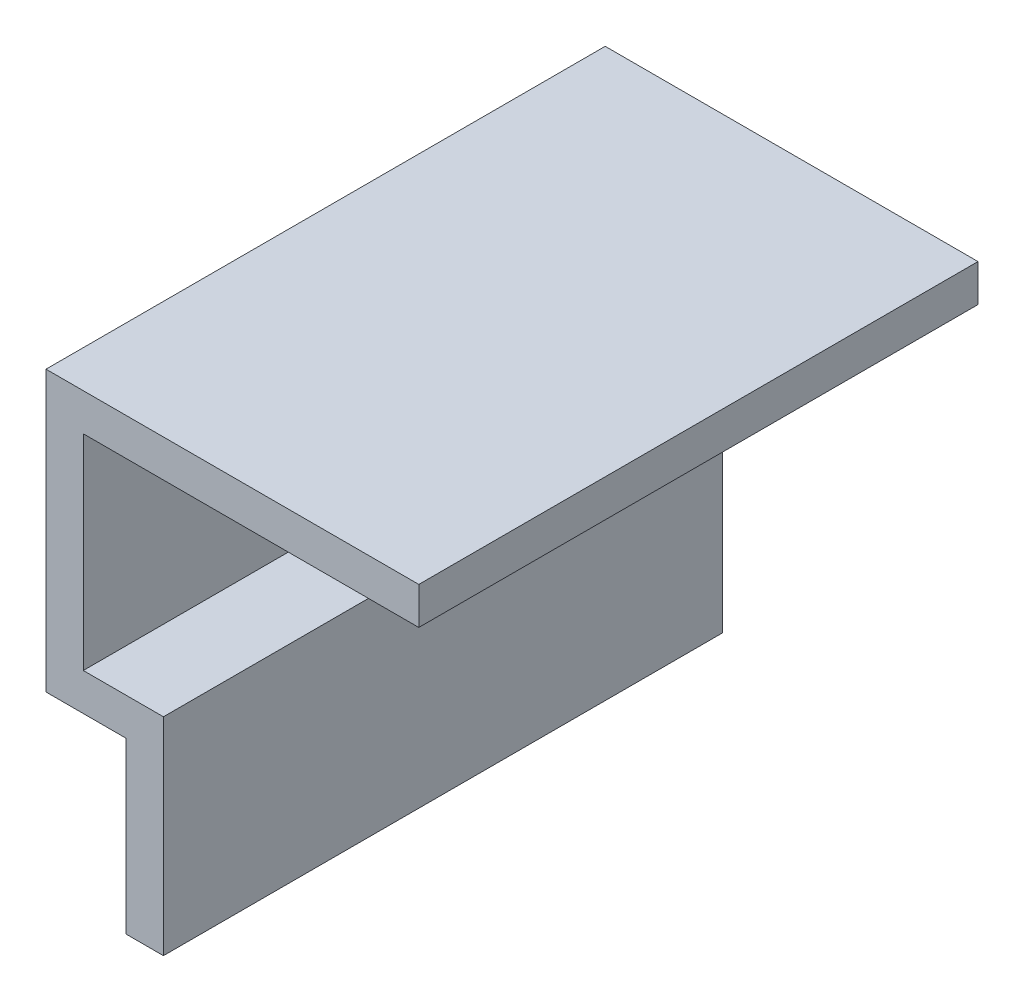
ISO-10303-21;
HEADER;
FILE_DESCRIPTION(('STEP AP214'),'2;1');
FILE_NAME('part.step','',(''),(''),'','','');
FILE_SCHEMA(('AUTOMOTIVE_DESIGN { 1 0 10303 214 1 1 1 1 }'));
ENDSEC;
DATA;
#1=APPLICATION_CONTEXT('core data for automotive mechanical design processes');
#2=APPLICATION_PROTOCOL_DEFINITION('international standard','automotive_design',2000,#1);
#3=PRODUCT_CONTEXT('',#1,'mechanical');
#4=PRODUCT('Part','Part','',(#3));
#5=PRODUCT_RELATED_PRODUCT_CATEGORY('part','',(#4));
#6=PRODUCT_DEFINITION_FORMATION('','',#4);
#7=PRODUCT_DEFINITION_CONTEXT('part definition',#1,'design');
#8=PRODUCT_DEFINITION('design','',#6,#7);
#9=PRODUCT_DEFINITION_SHAPE('','',#8);
#10=(LENGTH_UNIT() NAMED_UNIT(*) SI_UNIT(.MILLI.,.METRE.));
#11=(NAMED_UNIT(*) PLANE_ANGLE_UNIT() SI_UNIT($,.RADIAN.));
#12=(NAMED_UNIT(*) SI_UNIT($,.STERADIAN.) SOLID_ANGLE_UNIT());
#13=UNCERTAINTY_MEASURE_WITH_UNIT(LENGTH_MEASURE(1.E-05),#10,'distance_accuracy_value','');
#14=(GEOMETRIC_REPRESENTATION_CONTEXT(3) GLOBAL_UNCERTAINTY_ASSIGNED_CONTEXT((#13)) GLOBAL_UNIT_ASSIGNED_CONTEXT((#10,
#11,#12)) REPRESENTATION_CONTEXT('',''));
#15=CARTESIAN_POINT('',(0.,0.,0.));
#16=DIRECTION('',(0.,0.,1.));
#17=DIRECTION('',(1.,0.,0.));
#18=AXIS2_PLACEMENT_3D('',#15,#16,#17);
#19=CARTESIAN_POINT('',(-26.9502212653989,-18.1906845273691,30.));
#20=DIRECTION('',(0.,1.,0.));
#21=DIRECTION('',(0.,0.,1.));
#22=AXIS2_PLACEMENT_3D('',#19,#20,#21);
#23=PLANE('',#22);
#24=DIRECTION('',(1.,0.,0.));
#25=VECTOR('',#24,1.);
#26=CARTESIAN_POINT('',(-26.9502212653989,-18.1906845273691,0.));
#27=LINE('',#26,#25);
#28=CARTESIAN_POINT('',(-28.9502212653989,-18.1906845273691,0.));
#29=VERTEX_POINT('',#28);
#30=CARTESIAN_POINT('',(-26.9502212653989,-18.1906845273691,0.));
#31=VERTEX_POINT('',#30);
#32=EDGE_CURVE('E143',#29,#31,#27,.T.);
#33=ORIENTED_EDGE('',*,*,#32,.T.);
#34=DIRECTION('',(0.,0.,-1.));
#35=VECTOR('',#34,1.);
#36=CARTESIAN_POINT('',(-26.9502212653989,-18.1906845273691,30.));
#37=LINE('',#36,#35);
#38=CARTESIAN_POINT('',(-26.9502212653989,-18.1906845273691,30.));
#39=VERTEX_POINT('',#38);
#40=EDGE_CURVE('E11',#39,#31,#37,.T.);
#41=ORIENTED_EDGE('',*,*,#40,.F.);
#42=DIRECTION('',(1.,0.,0.));
#43=VECTOR('',#42,1.);
#44=CARTESIAN_POINT('',(-26.9502212653989,-18.1906845273691,30.));
#45=LINE('',#44,#43);
#46=CARTESIAN_POINT('',(-28.9502212653989,-18.1906845273691,30.));
#47=VERTEX_POINT('',#46);
#48=EDGE_CURVE('E161',#47,#39,#45,.T.);
#49=ORIENTED_EDGE('',*,*,#48,.F.);
#50=DIRECTION('',(0.,0.,-1.));
#51=VECTOR('',#50,1.);
#52=CARTESIAN_POINT('',(-28.9502212653989,-18.1906845273691,30.));
#53=LINE('',#52,#51);
#54=EDGE_CURVE('E139',#47,#29,#53,.T.);
#55=ORIENTED_EDGE('',*,*,#54,.T.);
#56=EDGE_LOOP('',(#33,#41,#49,#55));
#57=FACE_BOUND('',#56,.T.);
#58=ADVANCED_FACE('F35',(#57),#23,.F.);
#59=CARTESIAN_POINT('',(-26.9502212653989,-7.09068452736915,30.));
#60=DIRECTION('',(-1.,0.,0.));
#61=DIRECTION('',(0.,0.,1.));
#62=AXIS2_PLACEMENT_3D('',#59,#60,#61);
#63=PLANE('',#62);
#64=DIRECTION('',(0.,1.,0.));
#65=VECTOR('',#64,1.);
#66=CARTESIAN_POINT('',(-26.9502212653989,-7.09068452736915,0.));
#67=LINE('',#66,#65);
#68=CARTESIAN_POINT('',(-26.9502212653989,-7.09068452736915,0.));
#69=VERTEX_POINT('',#68);
#70=EDGE_CURVE('E146',#31,#69,#67,.T.);
#71=ORIENTED_EDGE('',*,*,#70,.T.);
#72=DIRECTION('',(0.,0.,-1.));
#73=VECTOR('',#72,1.);
#74=CARTESIAN_POINT('',(-26.9502212653989,-7.09068452736915,30.));
#75=LINE('',#74,#73);
#76=CARTESIAN_POINT('',(-26.9502212653989,-7.09068452736915,30.));
#77=VERTEX_POINT('',#76);
#78=EDGE_CURVE('E43',#77,#69,#75,.T.);
#79=ORIENTED_EDGE('',*,*,#78,.F.);
#80=DIRECTION('',(0.,1.,0.));
#81=VECTOR('',#80,1.);
#82=CARTESIAN_POINT('',(-26.9502212653989,-7.09068452736915,30.));
#83=LINE('',#82,#81);
#84=EDGE_CURVE('E100',#39,#77,#83,.T.);
#85=ORIENTED_EDGE('',*,*,#84,.F.);
#86=ORIENTED_EDGE('',*,*,#40,.T.);
#87=EDGE_LOOP('',(#71,#79,#85,#86));
#88=FACE_BOUND('',#87,.T.);
#89=ADVANCED_FACE('F210',(#88),#63,.F.);
#90=CARTESIAN_POINT('',(-31.2502212653989,-7.09068452736915,30.));
#91=DIRECTION('',(0.,-1.,0.));
#92=DIRECTION('',(0.,0.,-1.));
#93=AXIS2_PLACEMENT_3D('',#90,#91,#92);
#94=PLANE('',#93);
#95=DIRECTION('',(-1.,0.,0.));
#96=VECTOR('',#95,1.);
#97=CARTESIAN_POINT('',(-31.2502212653989,-7.09068452736915,0.));
#98=LINE('',#97,#96);
#99=CARTESIAN_POINT('',(-31.2502212653989,-7.09068452736915,0.));
#100=VERTEX_POINT('',#99);
#101=EDGE_CURVE('E148',#69,#100,#98,.T.);
#102=ORIENTED_EDGE('',*,*,#101,.T.);
#103=DIRECTION('',(0.,0.,-1.));
#104=VECTOR('',#103,1.);
#105=CARTESIAN_POINT('',(-31.2502212653989,-7.09068452736915,30.));
#106=LINE('',#105,#104);
#107=CARTESIAN_POINT('',(-31.2502212653989,-7.09068452736915,30.));
#108=VERTEX_POINT('',#107);
#109=EDGE_CURVE('E174',#108,#100,#106,.T.);
#110=ORIENTED_EDGE('',*,*,#109,.F.);
#111=DIRECTION('',(-1.,0.,0.));
#112=VECTOR('',#111,1.);
#113=CARTESIAN_POINT('',(-31.2502212653989,-7.09068452736915,30.));
#114=LINE('',#113,#112);
#115=EDGE_CURVE('E182',#77,#108,#114,.T.);
#116=ORIENTED_EDGE('',*,*,#115,.F.);
#117=ORIENTED_EDGE('',*,*,#78,.T.);
#118=EDGE_LOOP('',(#102,#110,#116,#117));
#119=FACE_BOUND('',#118,.T.);
#120=ADVANCED_FACE('F180',(#119),#94,.F.);
#121=CARTESIAN_POINT('',(-31.2502212653989,3.90931547263085,30.));
#122=DIRECTION('',(-1.,0.,0.));
#123=DIRECTION('',(0.,0.,1.));
#124=AXIS2_PLACEMENT_3D('',#121,#122,#123);
#125=PLANE('',#124);
#126=DIRECTION('',(0.,1.,0.));
#127=VECTOR('',#126,1.);
#128=CARTESIAN_POINT('',(-31.2502212653989,3.90931547263085,0.));
#129=LINE('',#128,#127);
#130=CARTESIAN_POINT('',(-31.2502212653989,3.90931547263085,0.));
#131=VERTEX_POINT('',#130);
#132=EDGE_CURVE('E150',#100,#131,#129,.T.);
#133=ORIENTED_EDGE('',*,*,#132,.T.);
#134=DIRECTION('',(0.,0.,-1.));
#135=VECTOR('',#134,1.);
#136=CARTESIAN_POINT('',(-31.2502212653989,3.90931547263085,30.));
#137=LINE('',#136,#135);
#138=CARTESIAN_POINT('',(-31.2502212653989,3.90931547263085,30.));
#139=VERTEX_POINT('',#138);
#140=EDGE_CURVE('E171',#139,#131,#137,.T.);
#141=ORIENTED_EDGE('',*,*,#140,.F.);
#142=DIRECTION('',(0.,1.,0.));
#143=VECTOR('',#142,1.);
#144=CARTESIAN_POINT('',(-31.2502212653989,3.90931547263085,30.));
#145=LINE('',#144,#143);
#146=EDGE_CURVE('E200',#108,#139,#145,.T.);
#147=ORIENTED_EDGE('',*,*,#146,.F.);
#148=ORIENTED_EDGE('',*,*,#109,.T.);
#149=EDGE_LOOP('',(#133,#141,#147,#148));
#150=FACE_BOUND('',#149,.T.);
#151=ADVANCED_FACE('F191',(#150),#125,.F.);
#152=CARTESIAN_POINT('',(-13.2502212653989,3.90931547263086,30.));
#153=DIRECTION('',(0.,1.,0.));
#154=DIRECTION('',(-1.,0.,0.));
#155=AXIS2_PLACEMENT_3D('',#152,#153,#154);
#156=PLANE('',#155);
#157=DIRECTION('',(1.,0.,0.));
#158=VECTOR('',#157,1.);
#159=CARTESIAN_POINT('',(-13.2502212653989,3.90931547263086,0.));
#160=LINE('',#159,#158);
#161=CARTESIAN_POINT('',(-13.2502212653989,3.90931547263086,0.));
#162=VERTEX_POINT('',#161);
#163=EDGE_CURVE('E152',#131,#162,#160,.T.);
#164=ORIENTED_EDGE('',*,*,#163,.T.);
#165=DIRECTION('',(0.,0.,-1.));
#166=VECTOR('',#165,1.);
#167=CARTESIAN_POINT('',(-13.2502212653989,3.90931547263086,30.));
#168=LINE('',#167,#166);
#169=CARTESIAN_POINT('',(-13.2502212653989,3.90931547263086,30.));
#170=VERTEX_POINT('',#169);
#171=EDGE_CURVE('E168',#170,#162,#168,.T.);
#172=ORIENTED_EDGE('',*,*,#171,.F.);
#173=DIRECTION('',(1.,0.,0.));
#174=VECTOR('',#173,1.);
#175=CARTESIAN_POINT('',(-13.2502212653989,3.90931547263086,30.));
#176=LINE('',#175,#174);
#177=EDGE_CURVE('E197',#139,#170,#176,.T.);
#178=ORIENTED_EDGE('',*,*,#177,.F.);
#179=ORIENTED_EDGE('',*,*,#140,.T.);
#180=EDGE_LOOP('',(#164,#172,#178,#179));
#181=FACE_BOUND('',#180,.T.);
#182=ADVANCED_FACE('F195',(#181),#156,.F.);
#183=CARTESIAN_POINT('',(-13.2502212653989,5.90931547263085,30.));
#184=DIRECTION('',(-1.,0.,0.));
#185=DIRECTION('',(0.,0.,1.));
#186=AXIS2_PLACEMENT_3D('',#183,#184,#185);
#187=PLANE('',#186);
#188=DIRECTION('',(0.,1.,0.));
#189=VECTOR('',#188,1.);
#190=CARTESIAN_POINT('',(-13.2502212653989,5.90931547263085,0.));
#191=LINE('',#190,#189);
#192=CARTESIAN_POINT('',(-13.2502212653989,5.90931547263085,0.));
#193=VERTEX_POINT('',#192);
#194=EDGE_CURVE('E154',#162,#193,#191,.T.);
#195=ORIENTED_EDGE('',*,*,#194,.T.);
#196=DIRECTION('',(0.,0.,-1.));
#197=VECTOR('',#196,1.);
#198=CARTESIAN_POINT('',(-13.2502212653989,5.90931547263085,30.));
#199=LINE('',#198,#197);
#200=CARTESIAN_POINT('',(-13.2502212653989,5.90931547263085,30.));
#201=VERTEX_POINT('',#200);
#202=EDGE_CURVE('E165',#201,#193,#199,.T.);
#203=ORIENTED_EDGE('',*,*,#202,.F.);
#204=DIRECTION('',(0.,1.,0.));
#205=VECTOR('',#204,1.);
#206=CARTESIAN_POINT('',(-13.2502212653989,5.90931547263085,30.));
#207=LINE('',#206,#205);
#208=EDGE_CURVE('E199',#170,#201,#207,.T.);
#209=ORIENTED_EDGE('',*,*,#208,.F.);
#210=ORIENTED_EDGE('',*,*,#171,.T.);
#211=EDGE_LOOP('',(#195,#203,#209,#210));
#212=FACE_BOUND('',#211,.T.);
#213=ADVANCED_FACE('F222',(#212),#187,.F.);
#214=CARTESIAN_POINT('',(-33.2502212653989,5.90931547263085,30.));
#215=DIRECTION('',(0.,-1.,0.));
#216=DIRECTION('',(0.,0.,-1.));
#217=AXIS2_PLACEMENT_3D('',#214,#215,#216);
#218=PLANE('',#217);
#219=DIRECTION('',(-1.,0.,0.));
#220=VECTOR('',#219,1.);
#221=CARTESIAN_POINT('',(-33.2502212653989,5.90931547263085,0.));
#222=LINE('',#221,#220);
#223=CARTESIAN_POINT('',(-33.2502212653989,5.90931547263085,0.));
#224=VERTEX_POINT('',#223);
#225=EDGE_CURVE('E156',#193,#224,#222,.T.);
#226=ORIENTED_EDGE('',*,*,#225,.T.);
#227=DIRECTION('',(0.,0.,-1.));
#228=VECTOR('',#227,1.);
#229=CARTESIAN_POINT('',(-33.2502212653989,5.90931547263085,30.));
#230=LINE('',#229,#228);
#231=CARTESIAN_POINT('',(-33.2502212653989,5.90931547263085,30.));
#232=VERTEX_POINT('',#231);
#233=EDGE_CURVE('E134',#232,#224,#230,.T.);
#234=ORIENTED_EDGE('',*,*,#233,.F.);
#235=DIRECTION('',(-1.,0.,0.));
#236=VECTOR('',#235,1.);
#237=CARTESIAN_POINT('',(-33.2502212653989,5.90931547263085,30.));
#238=LINE('',#237,#236);
#239=EDGE_CURVE('E125',#201,#232,#238,.T.);
#240=ORIENTED_EDGE('',*,*,#239,.F.);
#241=ORIENTED_EDGE('',*,*,#202,.T.);
#242=EDGE_LOOP('',(#226,#234,#240,#241));
#243=FACE_BOUND('',#242,.T.);
#244=ADVANCED_FACE('F225',(#243),#218,.F.);
#245=CARTESIAN_POINT('',(-33.2502212653989,-9.09068452736915,30.));
#246=DIRECTION('',(1.,0.,0.));
#247=DIRECTION('',(0.,0.,-1.));
#248=AXIS2_PLACEMENT_3D('',#245,#246,#247);
#249=PLANE('',#248);
#250=DIRECTION('',(0.,-1.,0.));
#251=VECTOR('',#250,1.);
#252=CARTESIAN_POINT('',(-33.2502212653989,-9.09068452736915,0.));
#253=LINE('',#252,#251);
#254=CARTESIAN_POINT('',(-33.2502212653989,-9.09068452736915,0.));
#255=VERTEX_POINT('',#254);
#256=EDGE_CURVE('E133',#224,#255,#253,.T.);
#257=ORIENTED_EDGE('',*,*,#256,.T.);
#258=DIRECTION('',(0.,0.,-1.));
#259=VECTOR('',#258,1.);
#260=CARTESIAN_POINT('',(-33.2502212653989,-9.09068452736915,30.));
#261=LINE('',#260,#259);
#262=CARTESIAN_POINT('',(-33.2502212653989,-9.09068452736915,30.));
#263=VERTEX_POINT('',#262);
#264=EDGE_CURVE('E130',#263,#255,#261,.T.);
#265=ORIENTED_EDGE('',*,*,#264,.F.);
#266=DIRECTION('',(0.,-1.,0.));
#267=VECTOR('',#266,1.);
#268=CARTESIAN_POINT('',(-33.2502212653989,-9.09068452736915,30.));
#269=LINE('',#268,#267);
#270=EDGE_CURVE('E119',#232,#263,#269,.T.);
#271=ORIENTED_EDGE('',*,*,#270,.F.);
#272=ORIENTED_EDGE('',*,*,#233,.T.);
#273=EDGE_LOOP('',(#257,#265,#271,#272));
#274=FACE_BOUND('',#273,.T.);
#275=ADVANCED_FACE('F131',(#274),#249,.F.);
#276=CARTESIAN_POINT('',(-28.9502212653989,-9.09068452736915,30.));
#277=DIRECTION('',(0.,1.,0.));
#278=DIRECTION('',(0.,0.,1.));
#279=AXIS2_PLACEMENT_3D('',#276,#277,#278);
#280=PLANE('',#279);
#281=DIRECTION('',(1.,0.,0.));
#282=VECTOR('',#281,1.);
#283=CARTESIAN_POINT('',(-28.9502212653989,-9.09068452736915,0.));
#284=LINE('',#283,#282);
#285=CARTESIAN_POINT('',(-28.9502212653989,-9.09068452736915,0.));
#286=VERTEX_POINT('',#285);
#287=EDGE_CURVE('E86',#255,#286,#284,.T.);
#288=ORIENTED_EDGE('',*,*,#287,.T.);
#289=DIRECTION('',(0.,0.,-1.));
#290=VECTOR('',#289,1.);
#291=CARTESIAN_POINT('',(-28.9502212653989,-9.09068452736915,30.));
#292=LINE('',#291,#290);
#293=CARTESIAN_POINT('',(-28.9502212653989,-9.09068452736915,30.));
#294=VERTEX_POINT('',#293);
#295=EDGE_CURVE('E135',#294,#286,#292,.T.);
#296=ORIENTED_EDGE('',*,*,#295,.F.);
#297=DIRECTION('',(1.,0.,0.));
#298=VECTOR('',#297,1.);
#299=CARTESIAN_POINT('',(-28.9502212653989,-9.09068452736915,30.));
#300=LINE('',#299,#298);
#301=EDGE_CURVE('E123',#263,#294,#300,.T.);
#302=ORIENTED_EDGE('',*,*,#301,.F.);
#303=ORIENTED_EDGE('',*,*,#264,.T.);
#304=EDGE_LOOP('',(#288,#296,#302,#303));
#305=FACE_BOUND('',#304,.T.);
#306=ADVANCED_FACE('F137',(#305),#280,.F.);
#307=CARTESIAN_POINT('',(-28.9502212653989,-18.1906845273691,30.));
#308=DIRECTION('',(1.,0.,0.));
#309=DIRECTION('',(0.,0.,-1.));
#310=AXIS2_PLACEMENT_3D('',#307,#308,#309);
#311=PLANE('',#310);
#312=DIRECTION('',(0.,-1.,0.));
#313=VECTOR('',#312,1.);
#314=CARTESIAN_POINT('',(-28.9502212653989,-18.1906845273691,0.));
#315=LINE('',#314,#313);
#316=EDGE_CURVE('E92',#286,#29,#315,.T.);
#317=ORIENTED_EDGE('',*,*,#316,.T.);
#318=ORIENTED_EDGE('',*,*,#54,.F.);
#319=DIRECTION('',(0.,-1.,0.));
#320=VECTOR('',#319,1.);
#321=CARTESIAN_POINT('',(-28.9502212653989,-18.1906845273691,30.));
#322=LINE('',#321,#320);
#323=EDGE_CURVE('E51',#294,#47,#322,.T.);
#324=ORIENTED_EDGE('',*,*,#323,.F.);
#325=ORIENTED_EDGE('',*,*,#295,.T.);
#326=EDGE_LOOP('',(#317,#318,#324,#325));
#327=FACE_BOUND('',#326,.T.);
#328=ADVANCED_FACE('F234',(#327),#311,.F.);
#329=CARTESIAN_POINT('',(0.,0.,30.));
#330=DIRECTION('',(0.,0.,-1.));
#331=DIRECTION('',(-1.,0.,0.));
#332=AXIS2_PLACEMENT_3D('',#329,#330,#331);
#333=PLANE('',#332);
#334=ORIENTED_EDGE('',*,*,#48,.T.);
#335=ORIENTED_EDGE('',*,*,#84,.T.);
#336=ORIENTED_EDGE('',*,*,#115,.T.);
#337=ORIENTED_EDGE('',*,*,#146,.T.);
#338=ORIENTED_EDGE('',*,*,#177,.T.);
#339=ORIENTED_EDGE('',*,*,#208,.T.);
#340=ORIENTED_EDGE('',*,*,#239,.T.);
#341=ORIENTED_EDGE('',*,*,#270,.T.);
#342=ORIENTED_EDGE('',*,*,#301,.T.);
#343=ORIENTED_EDGE('',*,*,#323,.T.);
#344=EDGE_LOOP('',(#334,#335,#336,#337,#338,#339,#340,#341,#342,#343));
#345=FACE_BOUND('',#344,.T.);
#346=ADVANCED_FACE('F121',(#345),#333,.F.);
#347=CARTESIAN_POINT('',(0.,0.,0.));
#348=DIRECTION('',(0.,0.,-1.));
#349=DIRECTION('',(-1.,0.,0.));
#350=AXIS2_PLACEMENT_3D('',#347,#348,#349);
#351=PLANE('',#350);
#352=ORIENTED_EDGE('',*,*,#32,.F.);
#353=ORIENTED_EDGE('',*,*,#316,.F.);
#354=ORIENTED_EDGE('',*,*,#287,.F.);
#355=ORIENTED_EDGE('',*,*,#256,.F.);
#356=ORIENTED_EDGE('',*,*,#225,.F.);
#357=ORIENTED_EDGE('',*,*,#194,.F.);
#358=ORIENTED_EDGE('',*,*,#163,.F.);
#359=ORIENTED_EDGE('',*,*,#132,.F.);
#360=ORIENTED_EDGE('',*,*,#101,.F.);
#361=ORIENTED_EDGE('',*,*,#70,.F.);
#362=EDGE_LOOP('',(#352,#353,#354,#355,#356,#357,#358,#359,#360,#361));
#363=FACE_BOUND('',#362,.T.);
#364=ADVANCED_FACE('F186',(#363),#351,.T.);
#365=CLOSED_SHELL('',(#58,#89,#120,#151,#182,#213,#244,#275,#306,#328,#346,#364));
#366=MANIFOLD_SOLID_BREP('B2',#365);
#367=ADVANCED_BREP_SHAPE_REPRESENTATION('',(#18,#366),#14);
#368=SHAPE_DEFINITION_REPRESENTATION(#9,#367);
ENDSEC;
END-ISO-10303-21;
